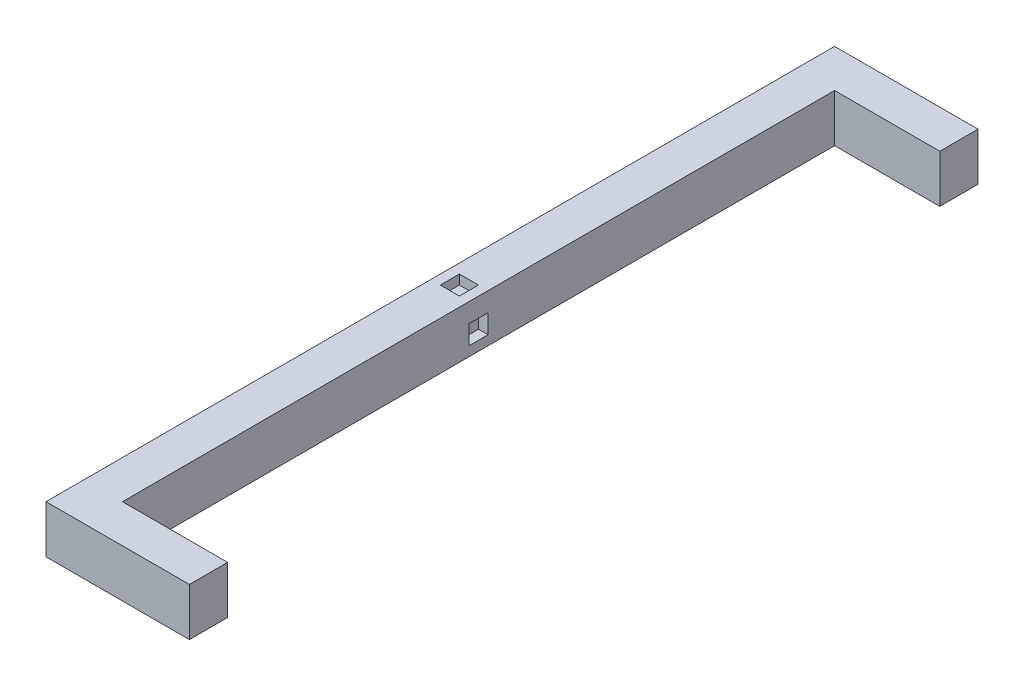
ISO-10303-21;
HEADER;
FILE_DESCRIPTION(('STEP AP214'),'2;1');
FILE_NAME('part.step','',(''),(''),'','','');
FILE_SCHEMA(('AUTOMOTIVE_DESIGN { 1 0 10303 214 1 1 1 1 }'));
ENDSEC;
DATA;
#1=APPLICATION_CONTEXT('core data for automotive mechanical design processes');
#2=APPLICATION_PROTOCOL_DEFINITION('international standard','automotive_design',2000,#1);
#3=PRODUCT_CONTEXT('',#1,'mechanical');
#4=PRODUCT('Part','Part','',(#3));
#5=PRODUCT_RELATED_PRODUCT_CATEGORY('part','',(#4));
#6=PRODUCT_DEFINITION_FORMATION('','',#4);
#7=PRODUCT_DEFINITION_CONTEXT('part definition',#1,'design');
#8=PRODUCT_DEFINITION('design','',#6,#7);
#9=PRODUCT_DEFINITION_SHAPE('','',#8);
#10=(LENGTH_UNIT() NAMED_UNIT(*) SI_UNIT(.MILLI.,.METRE.));
#11=(NAMED_UNIT(*) PLANE_ANGLE_UNIT() SI_UNIT($,.RADIAN.));
#12=(NAMED_UNIT(*) SI_UNIT($,.STERADIAN.) SOLID_ANGLE_UNIT());
#13=UNCERTAINTY_MEASURE_WITH_UNIT(LENGTH_MEASURE(1.E-05),#10,'distance_accuracy_value','');
#14=(GEOMETRIC_REPRESENTATION_CONTEXT(3) GLOBAL_UNCERTAINTY_ASSIGNED_CONTEXT((#13)) GLOBAL_UNIT_ASSIGNED_CONTEXT((#10,
#11,#12)) REPRESENTATION_CONTEXT('',''));
#15=CARTESIAN_POINT('',(0.,0.,0.));
#16=DIRECTION('',(0.,0.,1.));
#17=DIRECTION('',(1.,0.,0.));
#18=AXIS2_PLACEMENT_3D('',#15,#16,#17);
#19=CARTESIAN_POINT('',(8.,0.,165.));
#20=DIRECTION('',(-1.,0.,0.));
#21=DIRECTION('',(0.,0.,1.));
#22=AXIS2_PLACEMENT_3D('',#19,#20,#21);
#23=PLANE('',#22);
#24=DIRECTION('',(0.,0.,-1.));
#25=VECTOR('',#24,1.);
#26=CARTESIAN_POINT('',(8.,2.,80.5));
#27=LINE('',#26,#25);
#28=CARTESIAN_POINT('',(8.,2.,84.5));
#29=VERTEX_POINT('',#28);
#30=CARTESIAN_POINT('',(8.,2.,80.5));
#31=VERTEX_POINT('',#30);
#32=EDGE_CURVE('E175',#29,#31,#27,.T.);
#33=ORIENTED_EDGE('',*,*,#32,.F.);
#34=DIRECTION('',(0.,-1.,0.));
#35=VECTOR('',#34,1.);
#36=CARTESIAN_POINT('',(8.,2.,84.5));
#37=LINE('',#36,#35);
#38=CARTESIAN_POINT('',(8.,6.,84.5));
#39=VERTEX_POINT('',#38);
#40=EDGE_CURVE('E48',#39,#29,#37,.T.);
#41=ORIENTED_EDGE('',*,*,#40,.F.);
#42=DIRECTION('',(0.,0.,1.));
#43=VECTOR('',#42,1.);
#44=CARTESIAN_POINT('',(8.,6.,80.5));
#45=LINE('',#44,#43);
#46=CARTESIAN_POINT('',(8.,6.,80.5));
#47=VERTEX_POINT('',#46);
#48=EDGE_CURVE('E166',#47,#39,#45,.T.);
#49=ORIENTED_EDGE('',*,*,#48,.F.);
#50=DIRECTION('',(0.,1.,0.));
#51=VECTOR('',#50,1.);
#52=CARTESIAN_POINT('',(8.,2.,80.5));
#53=LINE('',#52,#51);
#54=EDGE_CURVE('E169',#31,#47,#53,.T.);
#55=ORIENTED_EDGE('',*,*,#54,.F.);
#56=EDGE_LOOP('',(#33,#41,#49,#55));
#57=FACE_BOUND('',#56,.T.);
#58=DIRECTION('',(0.,-1.,0.));
#59=VECTOR('',#58,1.);
#60=CARTESIAN_POINT('',(8.,0.,8.00000000000001));
#61=LINE('',#60,#59);
#62=CARTESIAN_POINT('',(8.,10.,8.00000000000001));
#63=VERTEX_POINT('',#62);
#64=CARTESIAN_POINT('',(8.,0.,8.00000000000001));
#65=VERTEX_POINT('',#64);
#66=EDGE_CURVE('E209',#63,#65,#61,.T.);
#67=ORIENTED_EDGE('',*,*,#66,.F.);
#68=DIRECTION('',(0.,0.,-1.));
#69=VECTOR('',#68,1.);
#70=CARTESIAN_POINT('',(8.,10.,165.));
#71=LINE('',#70,#69);
#72=CARTESIAN_POINT('',(8.,10.,157.));
#73=VERTEX_POINT('',#72);
#74=EDGE_CURVE('E269',#73,#63,#71,.T.);
#75=ORIENTED_EDGE('',*,*,#74,.F.);
#76=DIRECTION('',(0.,1.,0.));
#77=VECTOR('',#76,1.);
#78=CARTESIAN_POINT('',(8.,0.,157.));
#79=LINE('',#78,#77);
#80=CARTESIAN_POINT('',(8.,0.,157.));
#81=VERTEX_POINT('',#80);
#82=EDGE_CURVE('E233',#81,#73,#79,.T.);
#83=ORIENTED_EDGE('',*,*,#82,.F.);
#84=DIRECTION('',(0.,0.,-1.));
#85=VECTOR('',#84,1.);
#86=CARTESIAN_POINT('',(8.,0.,165.));
#87=LINE('',#86,#85);
#88=EDGE_CURVE('E41',#81,#65,#87,.T.);
#89=ORIENTED_EDGE('',*,*,#88,.T.);
#90=EDGE_LOOP('',(#67,#75,#83,#89));
#91=FACE_BOUND('',#90,.T.);
#92=ADVANCED_FACE('F33',(#57,#91),#23,.F.);
#93=CARTESIAN_POINT('',(0.,0.,165.));
#94=DIRECTION('',(1.,0.,0.));
#95=DIRECTION('',(0.,0.,-1.));
#96=AXIS2_PLACEMENT_3D('',#93,#94,#95);
#97=PLANE('',#96);
#98=DIRECTION('',(0.,-1.,0.));
#99=VECTOR('',#98,1.);
#100=CARTESIAN_POINT('',(0.,0.,0.));
#101=LINE('',#100,#99);
#102=CARTESIAN_POINT('',(0.,10.,0.));
#103=VERTEX_POINT('',#102);
#104=CARTESIAN_POINT('',(0.,0.,0.));
#105=VERTEX_POINT('',#104);
#106=EDGE_CURVE('E252',#103,#105,#101,.T.);
#107=ORIENTED_EDGE('',*,*,#106,.T.);
#108=DIRECTION('',(0.,0.,-1.));
#109=VECTOR('',#108,1.);
#110=CARTESIAN_POINT('',(0.,0.,165.));
#111=LINE('',#110,#109);
#112=CARTESIAN_POINT('',(0.,0.,165.));
#113=VERTEX_POINT('',#112);
#114=EDGE_CURVE('E11',#113,#105,#111,.T.);
#115=ORIENTED_EDGE('',*,*,#114,.F.);
#116=DIRECTION('',(0.,-1.,0.));
#117=VECTOR('',#116,1.);
#118=CARTESIAN_POINT('',(0.,0.,165.));
#119=LINE('',#118,#117);
#120=CARTESIAN_POINT('',(0.,10.,165.));
#121=VERTEX_POINT('',#120);
#122=EDGE_CURVE('E253',#121,#113,#119,.T.);
#123=ORIENTED_EDGE('',*,*,#122,.F.);
#124=DIRECTION('',(0.,0.,-1.));
#125=VECTOR('',#124,1.);
#126=CARTESIAN_POINT('',(0.,10.,165.));
#127=LINE('',#126,#125);
#128=EDGE_CURVE('E261',#121,#103,#127,.T.);
#129=ORIENTED_EDGE('',*,*,#128,.T.);
#130=EDGE_LOOP('',(#107,#115,#123,#129));
#131=FACE_BOUND('',#130,.T.);
#132=ADVANCED_FACE('F35',(#131),#97,.F.);
#133=CARTESIAN_POINT('',(0.,0.,165.));
#134=DIRECTION('',(0.,1.,0.));
#135=DIRECTION('',(0.,0.,1.));
#136=AXIS2_PLACEMENT_3D('',#133,#134,#135);
#137=PLANE('',#136);
#138=DIRECTION('',(1.,0.,0.));
#139=VECTOR('',#138,1.);
#140=CARTESIAN_POINT('',(0.,0.,0.));
#141=LINE('',#140,#139);
#142=CARTESIAN_POINT('',(30.,0.,0.));
#143=VERTEX_POINT('',#142);
#144=EDGE_CURVE('E264',#105,#143,#141,.T.);
#145=ORIENTED_EDGE('',*,*,#144,.T.);
#146=DIRECTION('',(0.,0.,-1.));
#147=VECTOR('',#146,1.);
#148=CARTESIAN_POINT('',(30.,0.,0.));
#149=LINE('',#148,#147);
#150=CARTESIAN_POINT('',(30.,0.,8.00000000000001));
#151=VERTEX_POINT('',#150);
#152=EDGE_CURVE('E222',#151,#143,#149,.T.);
#153=ORIENTED_EDGE('',*,*,#152,.F.);
#154=DIRECTION('',(-1.,0.,0.));
#155=VECTOR('',#154,1.);
#156=CARTESIAN_POINT('',(30.,0.,8.00000000000001));
#157=LINE('',#156,#155);
#158=EDGE_CURVE('E225',#151,#65,#157,.T.);
#159=ORIENTED_EDGE('',*,*,#158,.T.);
#160=ORIENTED_EDGE('',*,*,#88,.F.);
#161=DIRECTION('',(-1.,0.,0.));
#162=VECTOR('',#161,1.);
#163=CARTESIAN_POINT('',(30.,0.,157.));
#164=LINE('',#163,#162);
#165=CARTESIAN_POINT('',(30.,0.,157.));
#166=VERTEX_POINT('',#165);
#167=EDGE_CURVE('E249',#166,#81,#164,.T.);
#168=ORIENTED_EDGE('',*,*,#167,.F.);
#169=DIRECTION('',(0.,0.,-1.));
#170=VECTOR('',#169,1.);
#171=CARTESIAN_POINT('',(30.,0.,165.));
#172=LINE('',#171,#170);
#173=CARTESIAN_POINT('',(30.,0.,165.));
#174=VERTEX_POINT('',#173);
#175=EDGE_CURVE('E237',#174,#166,#172,.T.);
#176=ORIENTED_EDGE('',*,*,#175,.F.);
#177=DIRECTION('',(1.,0.,0.));
#178=VECTOR('',#177,1.);
#179=CARTESIAN_POINT('',(0.,0.,165.));
#180=LINE('',#179,#178);
#181=EDGE_CURVE('E256',#113,#174,#180,.T.);
#182=ORIENTED_EDGE('',*,*,#181,.F.);
#183=ORIENTED_EDGE('',*,*,#114,.T.);
#184=EDGE_LOOP('',(#145,#153,#159,#160,#168,#176,#182,#183));
#185=FACE_BOUND('',#184,.T.);
#186=ADVANCED_FACE('F281',(#185),#137,.F.);
#187=CARTESIAN_POINT('',(0.,10.,165.));
#188=DIRECTION('',(0.,-1.,0.));
#189=DIRECTION('',(0.,0.,-1.));
#190=AXIS2_PLACEMENT_3D('',#187,#188,#189);
#191=PLANE('',#190);
#192=DIRECTION('',(1.,0.,0.));
#193=VECTOR('',#192,1.);
#194=CARTESIAN_POINT('',(5.99999999999997,10.,84.5));
#195=LINE('',#194,#193);
#196=CARTESIAN_POINT('',(1.99999999999997,10.,84.5));
#197=VERTEX_POINT('',#196);
#198=CARTESIAN_POINT('',(5.99999999999997,10.,84.5));
#199=VERTEX_POINT('',#198);
#200=EDGE_CURVE('E199',#197,#199,#195,.T.);
#201=ORIENTED_EDGE('',*,*,#200,.F.);
#202=DIRECTION('',(0.,0.,1.));
#203=VECTOR('',#202,1.);
#204=CARTESIAN_POINT('',(1.99999999999997,10.,84.5));
#205=LINE('',#204,#203);
#206=CARTESIAN_POINT('',(1.99999999999997,10.,80.5));
#207=VERTEX_POINT('',#206);
#208=EDGE_CURVE('E56',#207,#197,#205,.T.);
#209=ORIENTED_EDGE('',*,*,#208,.F.);
#210=DIRECTION('',(-1.,0.,0.));
#211=VECTOR('',#210,1.);
#212=CARTESIAN_POINT('',(5.99999999999997,10.,80.5));
#213=LINE('',#212,#211);
#214=CARTESIAN_POINT('',(5.99999999999997,10.,80.5));
#215=VERTEX_POINT('',#214);
#216=EDGE_CURVE('E188',#215,#207,#213,.T.);
#217=ORIENTED_EDGE('',*,*,#216,.F.);
#218=DIRECTION('',(0.,0.,-1.));
#219=VECTOR('',#218,1.);
#220=CARTESIAN_POINT('',(5.99999999999997,10.,84.5));
#221=LINE('',#220,#219);
#222=EDGE_CURVE('E202',#199,#215,#221,.T.);
#223=ORIENTED_EDGE('',*,*,#222,.F.);
#224=EDGE_LOOP('',(#201,#209,#217,#223));
#225=FACE_BOUND('',#224,.T.);
#226=DIRECTION('',(-1.,0.,0.));
#227=VECTOR('',#226,1.);
#228=CARTESIAN_POINT('',(0.,10.,0.));
#229=LINE('',#228,#227);
#230=CARTESIAN_POINT('',(30.,10.,0.));
#231=VERTEX_POINT('',#230);
#232=EDGE_CURVE('E257',#231,#103,#229,.T.);
#233=ORIENTED_EDGE('',*,*,#232,.T.);
#234=ORIENTED_EDGE('',*,*,#128,.F.);
#235=DIRECTION('',(-1.,0.,0.));
#236=VECTOR('',#235,1.);
#237=CARTESIAN_POINT('',(0.,10.,165.));
#238=LINE('',#237,#236);
#239=CARTESIAN_POINT('',(30.,10.,165.));
#240=VERTEX_POINT('',#239);
#241=EDGE_CURVE('E259',#240,#121,#238,.T.);
#242=ORIENTED_EDGE('',*,*,#241,.F.);
#243=DIRECTION('',(0.,0.,1.));
#244=VECTOR('',#243,1.);
#245=CARTESIAN_POINT('',(30.,10.,165.));
#246=LINE('',#245,#244);
#247=CARTESIAN_POINT('',(30.,10.,157.));
#248=VERTEX_POINT('',#247);
#249=EDGE_CURVE('E241',#248,#240,#246,.T.);
#250=ORIENTED_EDGE('',*,*,#249,.F.);
#251=DIRECTION('',(-1.,0.,0.));
#252=VECTOR('',#251,1.);
#253=CARTESIAN_POINT('',(30.,10.,157.));
#254=LINE('',#253,#252);
#255=EDGE_CURVE('E244',#248,#73,#254,.T.);
#256=ORIENTED_EDGE('',*,*,#255,.T.);
#257=ORIENTED_EDGE('',*,*,#74,.T.);
#258=DIRECTION('',(-1.,0.,0.));
#259=VECTOR('',#258,1.);
#260=CARTESIAN_POINT('',(30.,10.,8.00000000000001));
#261=LINE('',#260,#259);
#262=CARTESIAN_POINT('',(30.,10.,8.00000000000001));
#263=VERTEX_POINT('',#262);
#264=EDGE_CURVE('E230',#263,#63,#261,.T.);
#265=ORIENTED_EDGE('',*,*,#264,.F.);
#266=DIRECTION('',(0.,0.,1.));
#267=VECTOR('',#266,1.);
#268=CARTESIAN_POINT('',(30.,10.,0.));
#269=LINE('',#268,#267);
#270=EDGE_CURVE('E218',#231,#263,#269,.T.);
#271=ORIENTED_EDGE('',*,*,#270,.F.);
#272=EDGE_LOOP('',(#233,#234,#242,#250,#256,#257,#265,#271));
#273=FACE_BOUND('',#272,.T.);
#274=ADVANCED_FACE('F291',(#225,#273),#191,.F.);
#275=CARTESIAN_POINT('',(0.,0.,165.));
#276=DIRECTION('',(0.,0.,-1.));
#277=DIRECTION('',(-1.,0.,0.));
#278=AXIS2_PLACEMENT_3D('',#275,#276,#277);
#279=PLANE('',#278);
#280=ORIENTED_EDGE('',*,*,#122,.T.);
#281=ORIENTED_EDGE('',*,*,#181,.T.);
#282=DIRECTION('',(0.,-1.,0.));
#283=VECTOR('',#282,1.);
#284=CARTESIAN_POINT('',(30.,0.,165.));
#285=LINE('',#284,#283);
#286=EDGE_CURVE('E234',#240,#174,#285,.T.);
#287=ORIENTED_EDGE('',*,*,#286,.F.);
#288=ORIENTED_EDGE('',*,*,#241,.T.);
#289=EDGE_LOOP('',(#280,#281,#287,#288));
#290=FACE_BOUND('',#289,.T.);
#291=ADVANCED_FACE('F302',(#290),#279,.F.);
#292=CARTESIAN_POINT('',(0.,0.,0.));
#293=DIRECTION('',(0.,0.,-1.));
#294=DIRECTION('',(-1.,0.,0.));
#295=AXIS2_PLACEMENT_3D('',#292,#293,#294);
#296=PLANE('',#295);
#297=ORIENTED_EDGE('',*,*,#106,.F.);
#298=ORIENTED_EDGE('',*,*,#232,.F.);
#299=DIRECTION('',(0.,1.,0.));
#300=VECTOR('',#299,1.);
#301=CARTESIAN_POINT('',(30.,0.,0.));
#302=LINE('',#301,#300);
#303=EDGE_CURVE('E215',#143,#231,#302,.T.);
#304=ORIENTED_EDGE('',*,*,#303,.F.);
#305=ORIENTED_EDGE('',*,*,#144,.F.);
#306=EDGE_LOOP('',(#297,#298,#304,#305));
#307=FACE_BOUND('',#306,.T.);
#308=ADVANCED_FACE('F287',(#307),#296,.T.);
#309=CARTESIAN_POINT('',(30.,0.,157.));
#310=DIRECTION('',(0.,0.,1.));
#311=DIRECTION('',(1.,0.,0.));
#312=AXIS2_PLACEMENT_3D('',#309,#310,#311);
#313=PLANE('',#312);
#314=ORIENTED_EDGE('',*,*,#82,.T.);
#315=ORIENTED_EDGE('',*,*,#255,.F.);
#316=DIRECTION('',(0.,1.,0.));
#317=VECTOR('',#316,1.);
#318=CARTESIAN_POINT('',(30.,0.,157.));
#319=LINE('',#318,#317);
#320=EDGE_CURVE('E239',#166,#248,#319,.T.);
#321=ORIENTED_EDGE('',*,*,#320,.F.);
#322=ORIENTED_EDGE('',*,*,#167,.T.);
#323=EDGE_LOOP('',(#314,#315,#321,#322));
#324=FACE_BOUND('',#323,.T.);
#325=ADVANCED_FACE('F295',(#324),#313,.F.);
#326=CARTESIAN_POINT('',(30.,0.,0.));
#327=DIRECTION('',(-1.,0.,0.));
#328=DIRECTION('',(0.,0.,1.));
#329=AXIS2_PLACEMENT_3D('',#326,#327,#328);
#330=PLANE('',#329);
#331=ORIENTED_EDGE('',*,*,#286,.T.);
#332=ORIENTED_EDGE('',*,*,#175,.T.);
#333=ORIENTED_EDGE('',*,*,#320,.T.);
#334=ORIENTED_EDGE('',*,*,#249,.T.);
#335=EDGE_LOOP('',(#331,#332,#333,#334));
#336=FACE_BOUND('',#335,.T.);
#337=ADVANCED_FACE('F300',(#336),#330,.F.);
#338=CARTESIAN_POINT('',(30.,0.,8.00000000000001));
#339=DIRECTION('',(0.,0.,-1.));
#340=DIRECTION('',(-1.,0.,0.));
#341=AXIS2_PLACEMENT_3D('',#338,#339,#340);
#342=PLANE('',#341);
#343=ORIENTED_EDGE('',*,*,#66,.T.);
#344=ORIENTED_EDGE('',*,*,#158,.F.);
#345=DIRECTION('',(0.,-1.,0.));
#346=VECTOR('',#345,1.);
#347=CARTESIAN_POINT('',(30.,0.,8.00000000000001));
#348=LINE('',#347,#346);
#349=EDGE_CURVE('E220',#263,#151,#348,.T.);
#350=ORIENTED_EDGE('',*,*,#349,.F.);
#351=ORIENTED_EDGE('',*,*,#264,.T.);
#352=EDGE_LOOP('',(#343,#344,#350,#351));
#353=FACE_BOUND('',#352,.T.);
#354=ADVANCED_FACE('F277',(#353),#342,.F.);
#355=CARTESIAN_POINT('',(30.,0.,0.));
#356=DIRECTION('',(1.,0.,0.));
#357=DIRECTION('',(0.,0.,-1.));
#358=AXIS2_PLACEMENT_3D('',#355,#356,#357);
#359=PLANE('',#358);
#360=ORIENTED_EDGE('',*,*,#303,.T.);
#361=ORIENTED_EDGE('',*,*,#270,.T.);
#362=ORIENTED_EDGE('',*,*,#349,.T.);
#363=ORIENTED_EDGE('',*,*,#152,.T.);
#364=EDGE_LOOP('',(#360,#361,#362,#363));
#365=FACE_BOUND('',#364,.T.);
#366=ADVANCED_FACE('F284',(#365),#359,.T.);
#367=CARTESIAN_POINT('',(1.99999999999997,8.,84.5));
#368=DIRECTION('',(-1.,0.,0.));
#369=DIRECTION('',(0.,0.,1.));
#370=AXIS2_PLACEMENT_3D('',#367,#368,#369);
#371=PLANE('',#370);
#372=ORIENTED_EDGE('',*,*,#208,.T.);
#373=DIRECTION('',(0.,1.,0.));
#374=VECTOR('',#373,1.);
#375=CARTESIAN_POINT('',(1.99999999999997,8.,84.5));
#376=LINE('',#375,#374);
#377=CARTESIAN_POINT('',(1.99999999999997,8.,84.5));
#378=VERTEX_POINT('',#377);
#379=EDGE_CURVE('E197',#378,#197,#376,.T.);
#380=ORIENTED_EDGE('',*,*,#379,.F.);
#381=DIRECTION('',(0.,0.,1.));
#382=VECTOR('',#381,1.);
#383=CARTESIAN_POINT('',(1.99999999999997,8.,84.5));
#384=LINE('',#383,#382);
#385=CARTESIAN_POINT('',(1.99999999999997,8.,80.5));
#386=VERTEX_POINT('',#385);
#387=EDGE_CURVE('E184',#386,#378,#384,.T.);
#388=ORIENTED_EDGE('',*,*,#387,.F.);
#389=DIRECTION('',(0.,1.,0.));
#390=VECTOR('',#389,1.);
#391=CARTESIAN_POINT('',(1.99999999999997,8.,80.5));
#392=LINE('',#391,#390);
#393=EDGE_CURVE('E207',#386,#207,#392,.T.);
#394=ORIENTED_EDGE('',*,*,#393,.T.);
#395=EDGE_LOOP('',(#372,#380,#388,#394));
#396=FACE_BOUND('',#395,.T.);
#397=ADVANCED_FACE('F331',(#396),#371,.F.);
#398=CARTESIAN_POINT('',(5.99999999999997,8.,80.5));
#399=DIRECTION('',(0.,0.,-1.));
#400=DIRECTION('',(-1.,0.,0.));
#401=AXIS2_PLACEMENT_3D('',#398,#399,#400);
#402=PLANE('',#401);
#403=ORIENTED_EDGE('',*,*,#216,.T.);
#404=ORIENTED_EDGE('',*,*,#393,.F.);
#405=DIRECTION('',(-1.,0.,0.));
#406=VECTOR('',#405,1.);
#407=CARTESIAN_POINT('',(5.99999999999997,8.,80.5));
#408=LINE('',#407,#406);
#409=CARTESIAN_POINT('',(5.99999999999997,8.,80.5));
#410=VERTEX_POINT('',#409);
#411=EDGE_CURVE('E194',#410,#386,#408,.T.);
#412=ORIENTED_EDGE('',*,*,#411,.F.);
#413=DIRECTION('',(0.,1.,0.));
#414=VECTOR('',#413,1.);
#415=CARTESIAN_POINT('',(5.99999999999997,8.,80.5));
#416=LINE('',#415,#414);
#417=EDGE_CURVE('E210',#410,#215,#416,.T.);
#418=ORIENTED_EDGE('',*,*,#417,.T.);
#419=EDGE_LOOP('',(#403,#404,#412,#418));
#420=FACE_BOUND('',#419,.T.);
#421=ADVANCED_FACE('F334',(#420),#402,.F.);
#422=CARTESIAN_POINT('',(5.99999999999997,8.,84.5));
#423=DIRECTION('',(1.,0.,0.));
#424=DIRECTION('',(0.,0.,-1.));
#425=AXIS2_PLACEMENT_3D('',#422,#423,#424);
#426=PLANE('',#425);
#427=ORIENTED_EDGE('',*,*,#222,.T.);
#428=ORIENTED_EDGE('',*,*,#417,.F.);
#429=DIRECTION('',(0.,0.,-1.));
#430=VECTOR('',#429,1.);
#431=CARTESIAN_POINT('',(5.99999999999997,8.,84.5));
#432=LINE('',#431,#430);
#433=CARTESIAN_POINT('',(5.99999999999997,8.,84.5));
#434=VERTEX_POINT('',#433);
#435=EDGE_CURVE('E191',#434,#410,#432,.T.);
#436=ORIENTED_EDGE('',*,*,#435,.F.);
#437=DIRECTION('',(0.,1.,0.));
#438=VECTOR('',#437,1.);
#439=CARTESIAN_POINT('',(5.99999999999997,8.,84.5));
#440=LINE('',#439,#438);
#441=EDGE_CURVE('E212',#434,#199,#440,.T.);
#442=ORIENTED_EDGE('',*,*,#441,.T.);
#443=EDGE_LOOP('',(#427,#428,#436,#442));
#444=FACE_BOUND('',#443,.T.);
#445=ADVANCED_FACE('F339',(#444),#426,.F.);
#446=CARTESIAN_POINT('',(5.99999999999997,8.,84.5));
#447=DIRECTION('',(0.,0.,1.));
#448=DIRECTION('',(1.,0.,0.));
#449=AXIS2_PLACEMENT_3D('',#446,#447,#448);
#450=PLANE('',#449);
#451=ORIENTED_EDGE('',*,*,#200,.T.);
#452=ORIENTED_EDGE('',*,*,#441,.F.);
#453=DIRECTION('',(1.,0.,0.));
#454=VECTOR('',#453,1.);
#455=CARTESIAN_POINT('',(5.99999999999997,8.,84.5));
#456=LINE('',#455,#454);
#457=EDGE_CURVE('E187',#378,#434,#456,.T.);
#458=ORIENTED_EDGE('',*,*,#457,.F.);
#459=ORIENTED_EDGE('',*,*,#379,.T.);
#460=EDGE_LOOP('',(#451,#452,#458,#459));
#461=FACE_BOUND('',#460,.T.);
#462=ADVANCED_FACE('F335',(#461),#450,.F.);
#463=CARTESIAN_POINT('',(0.,8.,0.));
#464=DIRECTION('',(0.,1.,0.));
#465=DIRECTION('',(0.,0.,1.));
#466=AXIS2_PLACEMENT_3D('',#463,#464,#465);
#467=PLANE('',#466);
#468=ORIENTED_EDGE('',*,*,#387,.T.);
#469=ORIENTED_EDGE('',*,*,#457,.T.);
#470=ORIENTED_EDGE('',*,*,#435,.T.);
#471=ORIENTED_EDGE('',*,*,#411,.T.);
#472=EDGE_LOOP('',(#468,#469,#470,#471));
#473=FACE_BOUND('',#472,.T.);
#474=ADVANCED_FACE('F338',(#473),#467,.T.);
#475=CARTESIAN_POINT('',(6.,2.,84.5));
#476=DIRECTION('',(0.,0.,1.));
#477=DIRECTION('',(1.,0.,0.));
#478=AXIS2_PLACEMENT_3D('',#475,#476,#477);
#479=PLANE('',#478);
#480=ORIENTED_EDGE('',*,*,#40,.T.);
#481=DIRECTION('',(1.,0.,0.));
#482=VECTOR('',#481,1.);
#483=CARTESIAN_POINT('',(6.,2.,84.5));
#484=LINE('',#483,#482);
#485=CARTESIAN_POINT('',(6.,2.,84.5));
#486=VERTEX_POINT('',#485);
#487=EDGE_CURVE('E144',#486,#29,#484,.T.);
#488=ORIENTED_EDGE('',*,*,#487,.F.);
#489=DIRECTION('',(0.,-1.,0.));
#490=VECTOR('',#489,1.);
#491=CARTESIAN_POINT('',(6.,2.,84.5));
#492=LINE('',#491,#490);
#493=CARTESIAN_POINT('',(6.,6.,84.5));
#494=VERTEX_POINT('',#493);
#495=EDGE_CURVE('E148',#494,#486,#492,.T.);
#496=ORIENTED_EDGE('',*,*,#495,.F.);
#497=DIRECTION('',(1.,0.,0.));
#498=VECTOR('',#497,1.);
#499=CARTESIAN_POINT('',(6.,6.,84.5));
#500=LINE('',#499,#498);
#501=EDGE_CURVE('E179',#494,#39,#500,.T.);
#502=ORIENTED_EDGE('',*,*,#501,.T.);
#503=EDGE_LOOP('',(#480,#488,#496,#502));
#504=FACE_BOUND('',#503,.T.);
#505=ADVANCED_FACE('F146',(#504),#479,.F.);
#506=CARTESIAN_POINT('',(6.,6.,80.5));
#507=DIRECTION('',(0.,1.,0.));
#508=DIRECTION('',(0.,0.,1.));
#509=AXIS2_PLACEMENT_3D('',#506,#507,#508);
#510=PLANE('',#509);
#511=ORIENTED_EDGE('',*,*,#48,.T.);
#512=ORIENTED_EDGE('',*,*,#501,.F.);
#513=DIRECTION('',(0.,0.,1.));
#514=VECTOR('',#513,1.);
#515=CARTESIAN_POINT('',(6.,6.,80.5));
#516=LINE('',#515,#514);
#517=CARTESIAN_POINT('',(6.,6.,80.5));
#518=VERTEX_POINT('',#517);
#519=EDGE_CURVE('E154',#518,#494,#516,.T.);
#520=ORIENTED_EDGE('',*,*,#519,.F.);
#521=DIRECTION('',(1.,0.,0.));
#522=VECTOR('',#521,1.);
#523=CARTESIAN_POINT('',(6.,6.,80.5));
#524=LINE('',#523,#522);
#525=EDGE_CURVE('E181',#518,#47,#524,.T.);
#526=ORIENTED_EDGE('',*,*,#525,.T.);
#527=EDGE_LOOP('',(#511,#512,#520,#526));
#528=FACE_BOUND('',#527,.T.);
#529=ADVANCED_FACE('F352',(#528),#510,.F.);
#530=CARTESIAN_POINT('',(6.,2.,80.5));
#531=DIRECTION('',(0.,0.,-1.));
#532=DIRECTION('',(-1.,0.,0.));
#533=AXIS2_PLACEMENT_3D('',#530,#531,#532);
#534=PLANE('',#533);
#535=ORIENTED_EDGE('',*,*,#54,.T.);
#536=ORIENTED_EDGE('',*,*,#525,.F.);
#537=DIRECTION('',(0.,1.,0.));
#538=VECTOR('',#537,1.);
#539=CARTESIAN_POINT('',(6.,2.,80.5));
#540=LINE('',#539,#538);
#541=CARTESIAN_POINT('',(6.,2.,80.5));
#542=VERTEX_POINT('',#541);
#543=EDGE_CURVE('E162',#542,#518,#540,.T.);
#544=ORIENTED_EDGE('',*,*,#543,.F.);
#545=DIRECTION('',(1.,0.,0.));
#546=VECTOR('',#545,1.);
#547=CARTESIAN_POINT('',(6.,2.,80.5));
#548=LINE('',#547,#546);
#549=EDGE_CURVE('E153',#542,#31,#548,.T.);
#550=ORIENTED_EDGE('',*,*,#549,.T.);
#551=EDGE_LOOP('',(#535,#536,#544,#550));
#552=FACE_BOUND('',#551,.T.);
#553=ADVANCED_FACE('F355',(#552),#534,.F.);
#554=CARTESIAN_POINT('',(6.,2.,80.5));
#555=DIRECTION('',(0.,-1.,0.));
#556=DIRECTION('',(0.,0.,-1.));
#557=AXIS2_PLACEMENT_3D('',#554,#555,#556);
#558=PLANE('',#557);
#559=ORIENTED_EDGE('',*,*,#32,.T.);
#560=ORIENTED_EDGE('',*,*,#549,.F.);
#561=DIRECTION('',(0.,0.,-1.));
#562=VECTOR('',#561,1.);
#563=CARTESIAN_POINT('',(6.,2.,80.5));
#564=LINE('',#563,#562);
#565=EDGE_CURVE('E157',#486,#542,#564,.T.);
#566=ORIENTED_EDGE('',*,*,#565,.F.);
#567=ORIENTED_EDGE('',*,*,#487,.T.);
#568=EDGE_LOOP('',(#559,#560,#566,#567));
#569=FACE_BOUND('',#568,.T.);
#570=ADVANCED_FACE('F158',(#569),#558,.F.);
#571=CARTESIAN_POINT('',(6.,0.,0.));
#572=DIRECTION('',(1.,0.,0.));
#573=DIRECTION('',(0.,0.,-1.));
#574=AXIS2_PLACEMENT_3D('',#571,#572,#573);
#575=PLANE('',#574);
#576=ORIENTED_EDGE('',*,*,#495,.T.);
#577=ORIENTED_EDGE('',*,*,#565,.T.);
#578=ORIENTED_EDGE('',*,*,#543,.T.);
#579=ORIENTED_EDGE('',*,*,#519,.T.);
#580=EDGE_LOOP('',(#576,#577,#578,#579));
#581=FACE_BOUND('',#580,.T.);
#582=ADVANCED_FACE('F164',(#581),#575,.T.);
#583=CLOSED_SHELL('',(#92,#132,#186,#274,#291,#308,#325,#337,#354,#366,#397,#421,#445,#462,#474,
#505,#529,#553,#570,#582));
#584=MANIFOLD_SOLID_BREP('B2',#583);
#585=ADVANCED_BREP_SHAPE_REPRESENTATION('',(#18,#584),#14);
#586=SHAPE_DEFINITION_REPRESENTATION(#9,#585);
ENDSEC;
END-ISO-10303-21;
